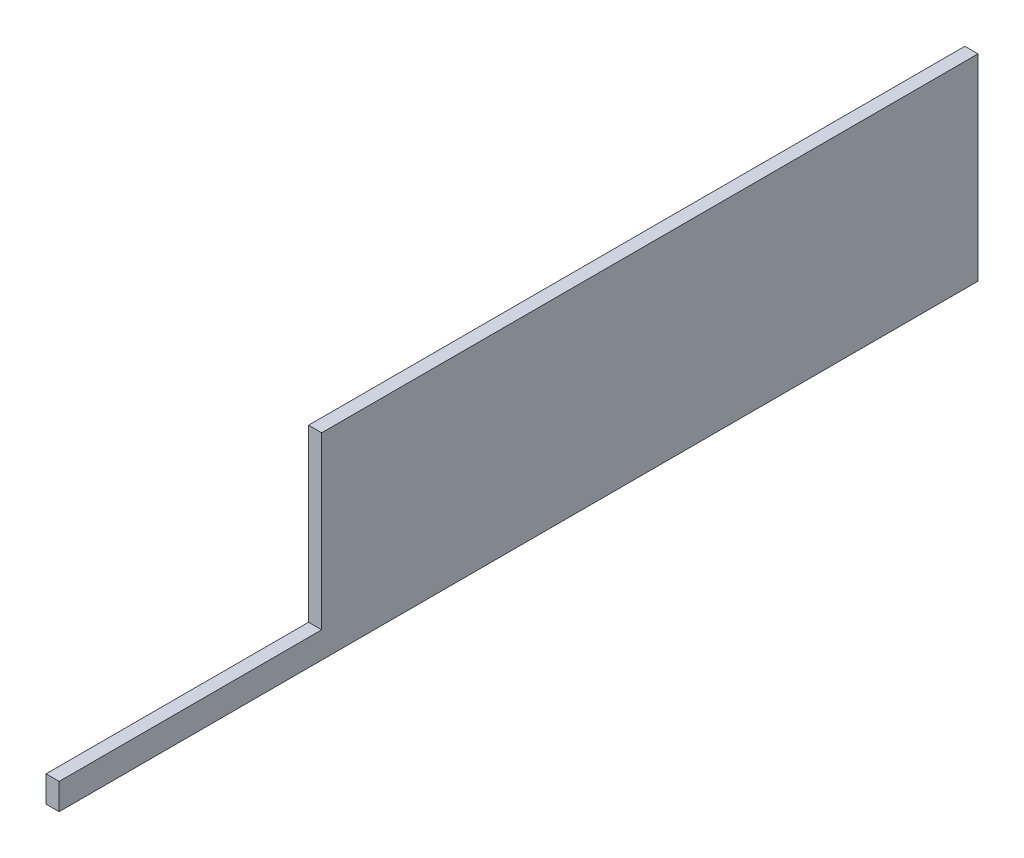
ISO-10303-21;
HEADER;
FILE_DESCRIPTION(('STEP AP214'),'2;1');
FILE_NAME('part.step','',(''),(''),'','','');
FILE_SCHEMA(('AUTOMOTIVE_DESIGN { 1 0 10303 214 1 1 1 1 }'));
ENDSEC;
DATA;
#1=APPLICATION_CONTEXT('core data for automotive mechanical design processes');
#2=APPLICATION_PROTOCOL_DEFINITION('international standard','automotive_design',2000,#1);
#3=PRODUCT_CONTEXT('',#1,'mechanical');
#4=PRODUCT('Part','Part','',(#3));
#5=PRODUCT_RELATED_PRODUCT_CATEGORY('part','',(#4));
#6=PRODUCT_DEFINITION_FORMATION('','',#4);
#7=PRODUCT_DEFINITION_CONTEXT('part definition',#1,'design');
#8=PRODUCT_DEFINITION('design','',#6,#7);
#9=PRODUCT_DEFINITION_SHAPE('','',#8);
#10=(LENGTH_UNIT() NAMED_UNIT(*) SI_UNIT(.MILLI.,.METRE.));
#11=(NAMED_UNIT(*) PLANE_ANGLE_UNIT() SI_UNIT($,.RADIAN.));
#12=(NAMED_UNIT(*) SI_UNIT($,.STERADIAN.) SOLID_ANGLE_UNIT());
#13=UNCERTAINTY_MEASURE_WITH_UNIT(LENGTH_MEASURE(1.E-05),#10,'distance_accuracy_value','');
#14=(GEOMETRIC_REPRESENTATION_CONTEXT(3) GLOBAL_UNCERTAINTY_ASSIGNED_CONTEXT((#13)) GLOBAL_UNIT_ASSIGNED_CONTEXT((#10,
#11,#12)) REPRESENTATION_CONTEXT('',''));
#15=CARTESIAN_POINT('',(0.,0.,0.));
#16=DIRECTION('',(0.,0.,1.));
#17=DIRECTION('',(1.,0.,0.));
#18=AXIS2_PLACEMENT_3D('',#15,#16,#17);
#19=CARTESIAN_POINT('',(1.,0.,45.));
#20=DIRECTION('',(0.,0.,1.));
#21=DIRECTION('',(1.,0.,0.));
#22=AXIS2_PLACEMENT_3D('',#19,#20,#21);
#23=PLANE('',#22);
#24=DIRECTION('',(0.,1.,0.));
#25=VECTOR('',#24,1.);
#26=CARTESIAN_POINT('',(0.,0.,45.));
#27=LINE('',#26,#25);
#28=CARTESIAN_POINT('',(0.,-7.5,45.));
#29=VERTEX_POINT('',#28);
#30=CARTESIAN_POINT('',(0.,-5.5,45.));
#31=VERTEX_POINT('',#30);
#32=EDGE_CURVE('E116',#29,#31,#27,.T.);
#33=ORIENTED_EDGE('',*,*,#32,.F.);
#34=DIRECTION('',(-1.,0.,0.));
#35=VECTOR('',#34,1.);
#36=CARTESIAN_POINT('',(1.,-7.5,45.));
#37=LINE('',#36,#35);
#38=CARTESIAN_POINT('',(1.,-7.5,45.));
#39=VERTEX_POINT('',#38);
#40=EDGE_CURVE('E11',#39,#29,#37,.T.);
#41=ORIENTED_EDGE('',*,*,#40,.F.);
#42=DIRECTION('',(0.,1.,0.));
#43=VECTOR('',#42,1.);
#44=CARTESIAN_POINT('',(1.,0.,45.));
#45=LINE('',#44,#43);
#46=CARTESIAN_POINT('',(1.,-5.5,45.));
#47=VERTEX_POINT('',#46);
#48=EDGE_CURVE('E130',#39,#47,#45,.T.);
#49=ORIENTED_EDGE('',*,*,#48,.T.);
#50=DIRECTION('',(-1.,0.,0.));
#51=VECTOR('',#50,1.);
#52=CARTESIAN_POINT('',(1.,-5.5,45.));
#53=LINE('',#52,#51);
#54=EDGE_CURVE('E79',#47,#31,#53,.T.);
#55=ORIENTED_EDGE('',*,*,#54,.T.);
#56=EDGE_LOOP('',(#33,#41,#49,#55));
#57=FACE_BOUND('',#56,.T.);
#58=ADVANCED_FACE('F35',(#57),#23,.T.);
#59=CARTESIAN_POINT('',(1.,-7.49999999999999,0.));
#60=DIRECTION('',(0.,-1.,0.));
#61=DIRECTION('',(0.,0.,-1.));
#62=AXIS2_PLACEMENT_3D('',#59,#60,#61);
#63=PLANE('',#62);
#64=DIRECTION('',(0.,0.,1.));
#65=VECTOR('',#64,1.);
#66=CARTESIAN_POINT('',(0.,-7.49999999999999,0.));
#67=LINE('',#66,#65);
#68=CARTESIAN_POINT('',(0.,-7.5,-25.));
#69=VERTEX_POINT('',#68);
#70=EDGE_CURVE('E119',#69,#29,#67,.T.);
#71=ORIENTED_EDGE('',*,*,#70,.F.);
#72=DIRECTION('',(-1.,0.,0.));
#73=VECTOR('',#72,1.);
#74=CARTESIAN_POINT('',(1.,-7.5,-25.));
#75=LINE('',#74,#73);
#76=CARTESIAN_POINT('',(1.,-7.5,-25.));
#77=VERTEX_POINT('',#76);
#78=EDGE_CURVE('E43',#77,#69,#75,.T.);
#79=ORIENTED_EDGE('',*,*,#78,.F.);
#80=DIRECTION('',(0.,0.,1.));
#81=VECTOR('',#80,1.);
#82=CARTESIAN_POINT('',(1.,-7.49999999999999,0.));
#83=LINE('',#82,#81);
#84=EDGE_CURVE('E142',#77,#39,#83,.T.);
#85=ORIENTED_EDGE('',*,*,#84,.T.);
#86=ORIENTED_EDGE('',*,*,#40,.T.);
#87=EDGE_LOOP('',(#71,#79,#85,#86));
#88=FACE_BOUND('',#87,.T.);
#89=ADVANCED_FACE('F141',(#88),#63,.T.);
#90=CARTESIAN_POINT('',(1.,0.,-25.));
#91=DIRECTION('',(0.,0.,1.));
#92=DIRECTION('',(1.,0.,0.));
#93=AXIS2_PLACEMENT_3D('',#90,#91,#92);
#94=PLANE('',#93);
#95=DIRECTION('',(0.,1.,0.));
#96=VECTOR('',#95,1.);
#97=CARTESIAN_POINT('',(0.,0.,-25.));
#98=LINE('',#97,#96);
#99=CARTESIAN_POINT('',(0.,7.5,-25.));
#100=VERTEX_POINT('',#99);
#101=EDGE_CURVE('E122',#69,#100,#98,.T.);
#102=ORIENTED_EDGE('',*,*,#101,.T.);
#103=DIRECTION('',(-1.,0.,0.));
#104=VECTOR('',#103,1.);
#105=CARTESIAN_POINT('',(1.,7.5,-25.));
#106=LINE('',#105,#104);
#107=CARTESIAN_POINT('',(1.,7.5,-25.));
#108=VERTEX_POINT('',#107);
#109=EDGE_CURVE('E102',#108,#100,#106,.T.);
#110=ORIENTED_EDGE('',*,*,#109,.F.);
#111=DIRECTION('',(0.,1.,0.));
#112=VECTOR('',#111,1.);
#113=CARTESIAN_POINT('',(1.,0.,-25.));
#114=LINE('',#113,#112);
#115=EDGE_CURVE('E108',#77,#108,#114,.T.);
#116=ORIENTED_EDGE('',*,*,#115,.F.);
#117=ORIENTED_EDGE('',*,*,#78,.T.);
#118=EDGE_LOOP('',(#102,#110,#116,#117));
#119=FACE_BOUND('',#118,.T.);
#120=ADVANCED_FACE('F135',(#119),#94,.F.);
#121=CARTESIAN_POINT('',(1.,7.5,0.));
#122=DIRECTION('',(0.,1.,0.));
#123=DIRECTION('',(0.,0.,1.));
#124=AXIS2_PLACEMENT_3D('',#121,#122,#123);
#125=PLANE('',#124);
#126=DIRECTION('',(0.,0.,-1.));
#127=VECTOR('',#126,1.);
#128=CARTESIAN_POINT('',(0.,7.5,0.));
#129=LINE('',#128,#127);
#130=CARTESIAN_POINT('',(0.,7.5,25.));
#131=VERTEX_POINT('',#130);
#132=EDGE_CURVE('E97',#131,#100,#129,.T.);
#133=ORIENTED_EDGE('',*,*,#132,.F.);
#134=DIRECTION('',(-1.,0.,0.));
#135=VECTOR('',#134,1.);
#136=CARTESIAN_POINT('',(1.,7.5,25.));
#137=LINE('',#136,#135);
#138=CARTESIAN_POINT('',(1.,7.5,25.));
#139=VERTEX_POINT('',#138);
#140=EDGE_CURVE('E92',#139,#131,#137,.T.);
#141=ORIENTED_EDGE('',*,*,#140,.F.);
#142=DIRECTION('',(0.,0.,-1.));
#143=VECTOR('',#142,1.);
#144=CARTESIAN_POINT('',(1.,7.5,0.));
#145=LINE('',#144,#143);
#146=EDGE_CURVE('E95',#139,#108,#145,.T.);
#147=ORIENTED_EDGE('',*,*,#146,.T.);
#148=ORIENTED_EDGE('',*,*,#109,.T.);
#149=EDGE_LOOP('',(#133,#141,#147,#148));
#150=FACE_BOUND('',#149,.T.);
#151=ADVANCED_FACE('F94',(#150),#125,.T.);
#152=CARTESIAN_POINT('',(1.,0.,25.));
#153=DIRECTION('',(0.,0.,1.));
#154=DIRECTION('',(1.,0.,0.));
#155=AXIS2_PLACEMENT_3D('',#152,#153,#154);
#156=PLANE('',#155);
#157=DIRECTION('',(0.,1.,0.));
#158=VECTOR('',#157,1.);
#159=CARTESIAN_POINT('',(0.,0.,25.));
#160=LINE('',#159,#158);
#161=CARTESIAN_POINT('',(0.,-5.5,25.));
#162=VERTEX_POINT('',#161);
#163=EDGE_CURVE('E126',#162,#131,#160,.T.);
#164=ORIENTED_EDGE('',*,*,#163,.F.);
#165=DIRECTION('',(-1.,0.,0.));
#166=VECTOR('',#165,1.);
#167=CARTESIAN_POINT('',(1.,-5.5,25.));
#168=LINE('',#167,#166);
#169=CARTESIAN_POINT('',(1.,-5.5,25.));
#170=VERTEX_POINT('',#169);
#171=EDGE_CURVE('E72',#170,#162,#168,.T.);
#172=ORIENTED_EDGE('',*,*,#171,.F.);
#173=DIRECTION('',(0.,1.,0.));
#174=VECTOR('',#173,1.);
#175=CARTESIAN_POINT('',(1.,0.,25.));
#176=LINE('',#175,#174);
#177=EDGE_CURVE('E105',#170,#139,#176,.T.);
#178=ORIENTED_EDGE('',*,*,#177,.T.);
#179=ORIENTED_EDGE('',*,*,#140,.T.);
#180=EDGE_LOOP('',(#164,#172,#178,#179));
#181=FACE_BOUND('',#180,.T.);
#182=ADVANCED_FACE('F111',(#181),#156,.T.);
#183=CARTESIAN_POINT('',(1.,-5.5,0.));
#184=DIRECTION('',(0.,-1.,0.));
#185=DIRECTION('',(0.,0.,-1.));
#186=AXIS2_PLACEMENT_3D('',#183,#184,#185);
#187=PLANE('',#186);
#188=DIRECTION('',(0.,0.,1.));
#189=VECTOR('',#188,1.);
#190=CARTESIAN_POINT('',(0.,-5.5,0.));
#191=LINE('',#190,#189);
#192=EDGE_CURVE('E128',#162,#31,#191,.T.);
#193=ORIENTED_EDGE('',*,*,#192,.T.);
#194=ORIENTED_EDGE('',*,*,#54,.F.);
#195=DIRECTION('',(0.,0.,1.));
#196=VECTOR('',#195,1.);
#197=CARTESIAN_POINT('',(1.,-5.5,0.));
#198=LINE('',#197,#196);
#199=EDGE_CURVE('E51',#170,#47,#198,.T.);
#200=ORIENTED_EDGE('',*,*,#199,.F.);
#201=ORIENTED_EDGE('',*,*,#171,.T.);
#202=EDGE_LOOP('',(#193,#194,#200,#201));
#203=FACE_BOUND('',#202,.T.);
#204=ADVANCED_FACE('F143',(#203),#187,.F.);
#205=CARTESIAN_POINT('',(1.,0.,0.));
#206=DIRECTION('',(1.,0.,0.));
#207=DIRECTION('',(0.,0.,-1.));
#208=AXIS2_PLACEMENT_3D('',#205,#206,#207);
#209=PLANE('',#208);
#210=ORIENTED_EDGE('',*,*,#48,.F.);
#211=ORIENTED_EDGE('',*,*,#84,.F.);
#212=ORIENTED_EDGE('',*,*,#115,.T.);
#213=ORIENTED_EDGE('',*,*,#146,.F.);
#214=ORIENTED_EDGE('',*,*,#177,.F.);
#215=ORIENTED_EDGE('',*,*,#199,.T.);
#216=EDGE_LOOP('',(#210,#211,#212,#213,#214,#215));
#217=FACE_BOUND('',#216,.T.);
#218=ADVANCED_FACE('F104',(#217),#209,.T.);
#219=CARTESIAN_POINT('',(0.,0.,0.));
#220=DIRECTION('',(1.,0.,0.));
#221=DIRECTION('',(0.,0.,-1.));
#222=AXIS2_PLACEMENT_3D('',#219,#220,#221);
#223=PLANE('',#222);
#224=ORIENTED_EDGE('',*,*,#32,.T.);
#225=ORIENTED_EDGE('',*,*,#192,.F.);
#226=ORIENTED_EDGE('',*,*,#163,.T.);
#227=ORIENTED_EDGE('',*,*,#132,.T.);
#228=ORIENTED_EDGE('',*,*,#101,.F.);
#229=ORIENTED_EDGE('',*,*,#70,.T.);
#230=EDGE_LOOP('',(#224,#225,#226,#227,#228,#229));
#231=FACE_BOUND('',#230,.T.);
#232=ADVANCED_FACE('F140',(#231),#223,.F.);
#233=CLOSED_SHELL('',(#58,#89,#120,#151,#182,#204,#218,#232));
#234=MANIFOLD_SOLID_BREP('B2',#233);
#235=ADVANCED_BREP_SHAPE_REPRESENTATION('',(#18,#234),#14);
#236=SHAPE_DEFINITION_REPRESENTATION(#9,#235);
ENDSEC;
END-ISO-10303-21;
